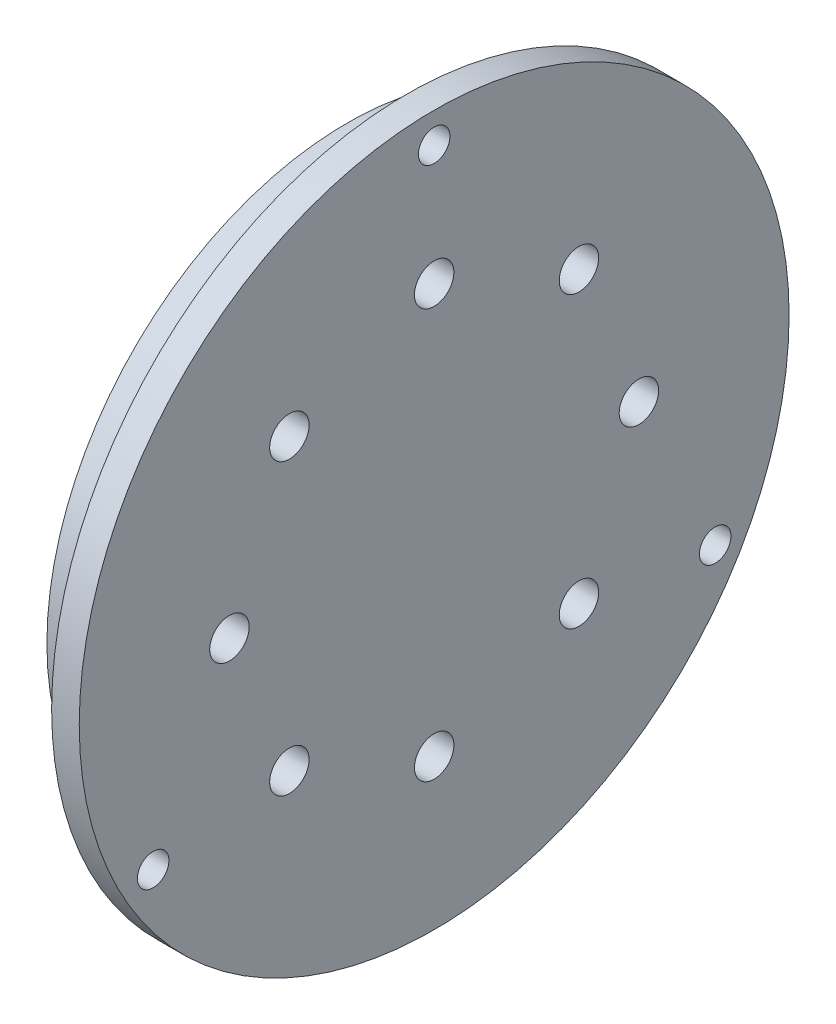
ISO-10303-21;
HEADER;
FILE_DESCRIPTION(('STEP AP214'),'2;1');
FILE_NAME('part.step','',(''),(''),'','','');
FILE_SCHEMA(('AUTOMOTIVE_DESIGN { 1 0 10303 214 1 1 1 1 }'));
ENDSEC;
DATA;
#1=APPLICATION_CONTEXT('core data for automotive mechanical design processes');
#2=APPLICATION_PROTOCOL_DEFINITION('international standard','automotive_design',2000,#1);
#3=PRODUCT_CONTEXT('',#1,'mechanical');
#4=PRODUCT('Part','Part','',(#3));
#5=PRODUCT_RELATED_PRODUCT_CATEGORY('part','',(#4));
#6=PRODUCT_DEFINITION_FORMATION('','',#4);
#7=PRODUCT_DEFINITION_CONTEXT('part definition',#1,'design');
#8=PRODUCT_DEFINITION('design','',#6,#7);
#9=PRODUCT_DEFINITION_SHAPE('','',#8);
#10=(LENGTH_UNIT() NAMED_UNIT(*) SI_UNIT(.MILLI.,.METRE.));
#11=(NAMED_UNIT(*) PLANE_ANGLE_UNIT() SI_UNIT($,.RADIAN.));
#12=(NAMED_UNIT(*) SI_UNIT($,.STERADIAN.) SOLID_ANGLE_UNIT());
#13=UNCERTAINTY_MEASURE_WITH_UNIT(LENGTH_MEASURE(1.E-05),#10,'distance_accuracy_value','');
#14=(GEOMETRIC_REPRESENTATION_CONTEXT(3) GLOBAL_UNCERTAINTY_ASSIGNED_CONTEXT((#13)) GLOBAL_UNIT_ASSIGNED_CONTEXT((#10,
#11,#12)) REPRESENTATION_CONTEXT('',''));
#15=CARTESIAN_POINT('',(0.,0.,0.));
#16=DIRECTION('',(0.,0.,1.));
#17=DIRECTION('',(1.,0.,0.));
#18=AXIS2_PLACEMENT_3D('',#15,#16,#17);
#19=CARTESIAN_POINT('',(0.,0.,0.));
#20=DIRECTION('',(-1.,0.,0.));
#21=DIRECTION('',(0.,0.,1.));
#22=AXIS2_PLACEMENT_3D('',#19,#20,#21);
#23=PLANE('',#22);
#24=CARTESIAN_POINT('',(0.,-1.81266086441026E-13,51.9166705616954));
#25=DIRECTION('',(-1.,0.,0.));
#26=DIRECTION('',(0.,-1.,0.));
#27=AXIS2_PLACEMENT_3D('',#24,#25,#26);
#28=CIRCLE('',#27,5.);
#29=CARTESIAN_POINT('',(0.,-5.00000000000018,51.9166705616953));
#30=VERTEX_POINT('',#29);
#31=EDGE_CURVE('E112',#30,#30,#28,.T.);
#32=ORIENTED_EDGE('',*,*,#31,.F.);
#33=EDGE_LOOP('',(#32));
#34=FACE_BOUND('',#33,.T.);
#35=CARTESIAN_POINT('',(0.,-36.710629810803,36.7106298108026));
#36=DIRECTION('',(-1.,0.,0.));
#37=DIRECTION('',(0.,-0.707106781186544,-0.707106781186551));
#38=AXIS2_PLACEMENT_3D('',#35,#36,#37);
#39=CIRCLE('',#38,5.);
#40=CARTESIAN_POINT('',(0.,-40.2461637167357,33.1750959048698));
#41=VERTEX_POINT('',#40);
#42=EDGE_CURVE('E116',#41,#41,#39,.T.);
#43=ORIENTED_EDGE('',*,*,#42,.F.);
#44=EDGE_LOOP('',(#43));
#45=FACE_BOUND('',#44,.T.);
#46=CARTESIAN_POINT('',(0.,-51.9166705616954,0.));
#47=DIRECTION('',(-1.,0.,0.));
#48=DIRECTION('',(0.,0.,-1.));
#49=AXIS2_PLACEMENT_3D('',#46,#47,#48);
#50=CIRCLE('',#49,5.);
#51=CARTESIAN_POINT('',(0.,-51.9166705616954,-5.));
#52=VERTEX_POINT('',#51);
#53=EDGE_CURVE('E120',#52,#52,#50,.T.);
#54=ORIENTED_EDGE('',*,*,#53,.F.);
#55=EDGE_LOOP('',(#54));
#56=FACE_BOUND('',#55,.T.);
#57=CARTESIAN_POINT('',(0.,-36.7106298108025,-36.7106298108031));
#58=DIRECTION('',(-1.,0.,0.));
#59=DIRECTION('',(0.,0.707106781186554,-0.707106781186541));
#60=AXIS2_PLACEMENT_3D('',#57,#58,#59);
#61=CIRCLE('',#60,5.);
#62=CARTESIAN_POINT('',(0.,-33.1750959048697,-40.2461637167358));
#63=VERTEX_POINT('',#62);
#64=EDGE_CURVE('E124',#63,#63,#61,.T.);
#65=ORIENTED_EDGE('',*,*,#64,.F.);
#66=EDGE_LOOP('',(#65));
#67=FACE_BOUND('',#66,.T.);
#68=CARTESIAN_POINT('',(0.,5.43798259323078E-13,-51.9166705616954));
#69=DIRECTION('',(-1.,0.,0.));
#70=DIRECTION('',(0.,1.,0.));
#71=AXIS2_PLACEMENT_3D('',#68,#69,#70);
#72=CIRCLE('',#71,5.);
#73=CARTESIAN_POINT('',(0.,5.00000000000054,-51.9166705616953));
#74=VERTEX_POINT('',#73);
#75=EDGE_CURVE('E128',#74,#74,#72,.T.);
#76=ORIENTED_EDGE('',*,*,#75,.F.);
#77=EDGE_LOOP('',(#76));
#78=FACE_BOUND('',#77,.T.);
#79=CARTESIAN_POINT('',(0.,36.7106298108032,-36.7106298108023));
#80=DIRECTION('',(-1.,0.,0.));
#81=DIRECTION('',(0.,0.707106781186539,0.707106781186556));
#82=AXIS2_PLACEMENT_3D('',#79,#80,#81);
#83=CIRCLE('',#82,5.);
#84=CARTESIAN_POINT('',(0.,40.2461637167359,-33.1750959048696));
#85=VERTEX_POINT('',#84);
#86=EDGE_CURVE('E132',#85,#85,#83,.T.);
#87=ORIENTED_EDGE('',*,*,#86,.F.);
#88=EDGE_LOOP('',(#87));
#89=FACE_BOUND('',#88,.T.);
#90=CARTESIAN_POINT('',(0.,36.7106298108027,36.7106298108029));
#91=DIRECTION('',(-1.,0.,0.));
#92=DIRECTION('',(0.,-0.707106781186549,0.707106781186546));
#93=AXIS2_PLACEMENT_3D('',#90,#91,#92);
#94=CIRCLE('',#93,5.);
#95=CARTESIAN_POINT('',(0.,33.17509590487,40.2461637167356));
#96=VERTEX_POINT('',#95);
#97=EDGE_CURVE('E136',#96,#96,#94,.T.);
#98=ORIENTED_EDGE('',*,*,#97,.F.);
#99=EDGE_LOOP('',(#98));
#100=FACE_BOUND('',#99,.T.);
#101=CARTESIAN_POINT('',(0.,51.9166705616954,0.));
#102=DIRECTION('',(-1.,0.,0.));
#103=DIRECTION('',(0.,0.,1.));
#104=AXIS2_PLACEMENT_3D('',#101,#102,#103);
#105=CIRCLE('',#104,5.);
#106=CARTESIAN_POINT('',(0.,51.9166705616954,5.));
#107=VERTEX_POINT('',#106);
#108=EDGE_CURVE('E68',#107,#107,#105,.T.);
#109=ORIENTED_EDGE('',*,*,#108,.F.);
#110=EDGE_LOOP('',(#109));
#111=FACE_BOUND('',#110,.T.);
#112=CARTESIAN_POINT('',(0.,0.,0.));
#113=DIRECTION('',(1.,0.,0.));
#114=DIRECTION('',(0.,0.,-1.));
#115=AXIS2_PLACEMENT_3D('',#112,#113,#114);
#116=CIRCLE('',#115,76.2);
#117=CARTESIAN_POINT('',(0.,0.,-76.2));
#118=VERTEX_POINT('',#117);
#119=EDGE_CURVE('E10',#118,#118,#116,.T.);
#120=ORIENTED_EDGE('',*,*,#119,.F.);
#121=EDGE_LOOP('',(#120));
#122=FACE_BOUND('',#121,.T.);
#123=ADVANCED_FACE('F33',(#34,#45,#56,#67,#78,#89,#100,#111,#122),#23,.T.);
#124=CARTESIAN_POINT('',(22.,0.,0.));
#125=DIRECTION('',(1.,0.,0.));
#126=DIRECTION('',(0.,0.,-1.));
#127=AXIS2_PLACEMENT_3D('',#124,#125,#126);
#128=CYLINDRICAL_SURFACE('',#127,76.2);
#129=ORIENTED_EDGE('',*,*,#119,.T.);
#130=EDGE_LOOP('',(#129));
#131=FACE_BOUND('',#130,.T.);
#132=CARTESIAN_POINT('',(5.47541952646213,0.,0.));
#133=DIRECTION('',(1.,0.,0.));
#134=DIRECTION('',(0.,0.,-1.));
#135=AXIS2_PLACEMENT_3D('',#132,#133,#134);
#136=CIRCLE('',#135,76.2);
#137=CARTESIAN_POINT('',(5.47541952646213,0.,-76.2));
#138=VERTEX_POINT('',#137);
#139=EDGE_CURVE('E40',#138,#138,#136,.T.);
#140=ORIENTED_EDGE('',*,*,#139,.F.);
#141=EDGE_LOOP('',(#140));
#142=FACE_BOUND('',#141,.T.);
#143=ADVANCED_FACE('F94',(#131,#142),#128,.T.);
#144=CARTESIAN_POINT('',(5.47541952646213,72.8465829878076,0.));
#145=DIRECTION('',(1.,0.,0.));
#146=DIRECTION('',(0.,0.,-1.));
#147=AXIS2_PLACEMENT_3D('',#144,#145,#146);
#148=PLANE('',#147);
#149=ORIENTED_EDGE('',*,*,#139,.T.);
#150=EDGE_LOOP('',(#149));
#151=FACE_BOUND('',#150,.T.);
#152=CARTESIAN_POINT('',(5.47541952646213,0.,0.));
#153=DIRECTION('',(1.,0.,0.));
#154=DIRECTION('',(0.,0.,-1.));
#155=AXIS2_PLACEMENT_3D('',#152,#153,#154);
#156=CIRCLE('',#155,72.8465829878076);
#157=CARTESIAN_POINT('',(5.47541952646213,0.,-72.8465829878076));
#158=VERTEX_POINT('',#157);
#159=EDGE_CURVE('E45',#158,#158,#156,.T.);
#160=ORIENTED_EDGE('',*,*,#159,.F.);
#161=EDGE_LOOP('',(#160));
#162=FACE_BOUND('',#161,.T.);
#163=ADVANCED_FACE('F92',(#151,#162),#148,.T.);
#164=CARTESIAN_POINT('',(22.,0.,0.));
#165=DIRECTION('',(1.,0.,0.));
#166=DIRECTION('',(0.,0.,-1.));
#167=AXIS2_PLACEMENT_3D('',#164,#165,#166);
#168=CYLINDRICAL_SURFACE('',#167,72.8465829878076);
#169=ORIENTED_EDGE('',*,*,#159,.T.);
#170=EDGE_LOOP('',(#169));
#171=FACE_BOUND('',#170,.T.);
#172=CARTESIAN_POINT('',(9.8226098235159,0.,0.));
#173=DIRECTION('',(1.,0.,0.));
#174=DIRECTION('',(0.,0.,-1.));
#175=AXIS2_PLACEMENT_3D('',#172,#173,#174);
#176=CIRCLE('',#175,72.8465829878076);
#177=CARTESIAN_POINT('',(9.8226098235159,0.,-72.8465829878076));
#178=VERTEX_POINT('',#177);
#179=EDGE_CURVE('E84',#178,#178,#176,.T.);
#180=ORIENTED_EDGE('',*,*,#179,.F.);
#181=EDGE_LOOP('',(#180));
#182=FACE_BOUND('',#181,.T.);
#183=ADVANCED_FACE('F89',(#171,#182),#168,.T.);
#184=CARTESIAN_POINT('',(9.8226098235159,76.2,0.));
#185=DIRECTION('',(-1.,0.,0.));
#186=DIRECTION('',(0.,0.,1.));
#187=AXIS2_PLACEMENT_3D('',#184,#185,#186);
#188=PLANE('',#187);
#189=ORIENTED_EDGE('',*,*,#179,.T.);
#190=EDGE_LOOP('',(#189));
#191=FACE_BOUND('',#190,.T.);
#192=CARTESIAN_POINT('',(9.8226098235159,0.,0.));
#193=DIRECTION('',(1.,0.,0.));
#194=DIRECTION('',(0.,0.,-1.));
#195=AXIS2_PLACEMENT_3D('',#192,#193,#194);
#196=CIRCLE('',#195,76.2);
#197=CARTESIAN_POINT('',(9.8226098235159,0.,-76.2));
#198=VERTEX_POINT('',#197);
#199=EDGE_CURVE('E81',#198,#198,#196,.T.);
#200=ORIENTED_EDGE('',*,*,#199,.F.);
#201=EDGE_LOOP('',(#200));
#202=FACE_BOUND('',#201,.T.);
#203=ADVANCED_FACE('F101',(#191,#202),#188,.T.);
#204=CARTESIAN_POINT('',(22.,0.,0.));
#205=DIRECTION('',(1.,0.,0.));
#206=DIRECTION('',(0.,0.,-1.));
#207=AXIS2_PLACEMENT_3D('',#204,#205,#206);
#208=CYLINDRICAL_SURFACE('',#207,76.2);
#209=ORIENTED_EDGE('',*,*,#199,.T.);
#210=EDGE_LOOP('',(#209));
#211=FACE_BOUND('',#210,.T.);
#212=CARTESIAN_POINT('',(15.,0.,0.));
#213=DIRECTION('',(1.,0.,0.));
#214=DIRECTION('',(0.,0.,-1.));
#215=AXIS2_PLACEMENT_3D('',#212,#213,#214);
#216=CIRCLE('',#215,76.2);
#217=CARTESIAN_POINT('',(15.,0.,-76.2));
#218=VERTEX_POINT('',#217);
#219=EDGE_CURVE('E78',#218,#218,#216,.T.);
#220=ORIENTED_EDGE('',*,*,#219,.F.);
#221=EDGE_LOOP('',(#220));
#222=FACE_BOUND('',#221,.T.);
#223=ADVANCED_FACE('F232',(#211,#222),#208,.T.);
#224=CARTESIAN_POINT('',(15.,76.2,0.));
#225=DIRECTION('',(-1.,0.,0.));
#226=DIRECTION('',(0.,0.,1.));
#227=AXIS2_PLACEMENT_3D('',#224,#225,#226);
#228=PLANE('',#227);
#229=CARTESIAN_POINT('',(15.,-41.1386633438073,71.2542550669448));
#230=DIRECTION('',(-1.,0.,0.));
#231=DIRECTION('',(0.,-0.866025403784436,-0.500000000000004));
#232=AXIS2_PLACEMENT_3D('',#229,#230,#231);
#233=CIRCLE('',#232,4.);
#234=CARTESIAN_POINT('',(15.,-44.602764958945,69.2542550669448));
#235=VERTEX_POINT('',#234);
#236=EDGE_CURVE('E55',#235,#235,#233,.T.);
#237=ORIENTED_EDGE('',*,*,#236,.F.);
#238=EDGE_LOOP('',(#237));
#239=FACE_BOUND('',#238,.T.);
#240=CARTESIAN_POINT('',(15.,-41.1386633438063,-71.2542550669453));
#241=DIRECTION('',(-1.,0.,0.));
#242=DIRECTION('',(0.,0.866025403784443,-0.499999999999992));
#243=AXIS2_PLACEMENT_3D('',#240,#241,#242);
#244=CIRCLE('',#243,4.);
#245=CARTESIAN_POINT('',(15.,-37.6745617286685,-73.2542550669453));
#246=VERTEX_POINT('',#245);
#247=EDGE_CURVE('E60',#246,#246,#244,.T.);
#248=ORIENTED_EDGE('',*,*,#247,.F.);
#249=EDGE_LOOP('',(#248));
#250=FACE_BOUND('',#249,.T.);
#251=CARTESIAN_POINT('',(15.,82.2773266876138,0.));
#252=DIRECTION('',(-1.,0.,0.));
#253=DIRECTION('',(0.,0.,1.));
#254=AXIS2_PLACEMENT_3D('',#251,#252,#253);
#255=CIRCLE('',#254,4.);
#256=CARTESIAN_POINT('',(15.,82.2773266876138,4.));
#257=VERTEX_POINT('',#256);
#258=EDGE_CURVE('E52',#257,#257,#255,.T.);
#259=ORIENTED_EDGE('',*,*,#258,.F.);
#260=EDGE_LOOP('',(#259));
#261=FACE_BOUND('',#260,.T.);
#262=ORIENTED_EDGE('',*,*,#219,.T.);
#263=EDGE_LOOP('',(#262));
#264=FACE_BOUND('',#263,.T.);
#265=CARTESIAN_POINT('',(15.,0.,0.));
#266=DIRECTION('',(1.,0.,0.));
#267=DIRECTION('',(0.,0.,-1.));
#268=AXIS2_PLACEMENT_3D('',#265,#266,#267);
#269=CIRCLE('',#268,90.);
#270=CARTESIAN_POINT('',(15.,0.,-90.));
#271=VERTEX_POINT('',#270);
#272=EDGE_CURVE('E75',#271,#271,#269,.T.);
#273=ORIENTED_EDGE('',*,*,#272,.F.);
#274=EDGE_LOOP('',(#273));
#275=FACE_BOUND('',#274,.T.);
#276=ADVANCED_FACE('F228',(#239,#250,#261,#264,#275),#228,.T.);
#277=CARTESIAN_POINT('',(22.,0.,0.));
#278=DIRECTION('',(1.,0.,0.));
#279=DIRECTION('',(0.,0.,-1.));
#280=AXIS2_PLACEMENT_3D('',#277,#278,#279);
#281=CYLINDRICAL_SURFACE('',#280,90.);
#282=ORIENTED_EDGE('',*,*,#272,.T.);
#283=EDGE_LOOP('',(#282));
#284=FACE_BOUND('',#283,.T.);
#285=CARTESIAN_POINT('',(22.,0.,0.));
#286=DIRECTION('',(1.,0.,0.));
#287=DIRECTION('',(0.,0.,-1.));
#288=AXIS2_PLACEMENT_3D('',#285,#286,#287);
#289=CIRCLE('',#288,90.);
#290=CARTESIAN_POINT('',(22.,0.,-90.));
#291=VERTEX_POINT('',#290);
#292=EDGE_CURVE('E51',#291,#291,#289,.T.);
#293=ORIENTED_EDGE('',*,*,#292,.F.);
#294=EDGE_LOOP('',(#293));
#295=FACE_BOUND('',#294,.T.);
#296=ADVANCED_FACE('F224',(#284,#295),#281,.T.);
#297=CARTESIAN_POINT('',(22.,90.,0.));
#298=DIRECTION('',(1.,0.,0.));
#299=DIRECTION('',(0.,0.,-1.));
#300=AXIS2_PLACEMENT_3D('',#297,#298,#299);
#301=PLANE('',#300);
#302=CARTESIAN_POINT('',(22.,-1.81266086441026E-13,51.9166705616954));
#303=DIRECTION('',(-1.,0.,0.));
#304=DIRECTION('',(0.,-1.,0.));
#305=AXIS2_PLACEMENT_3D('',#302,#303,#304);
#306=CIRCLE('',#305,5.);
#307=CARTESIAN_POINT('',(22.,-5.00000000000018,51.9166705616953));
#308=VERTEX_POINT('',#307);
#309=EDGE_CURVE('E147',#308,#308,#306,.T.);
#310=ORIENTED_EDGE('',*,*,#309,.T.);
#311=EDGE_LOOP('',(#310));
#312=FACE_BOUND('',#311,.T.);
#313=CARTESIAN_POINT('',(22.,-36.710629810803,36.7106298108026));
#314=DIRECTION('',(-1.,0.,0.));
#315=DIRECTION('',(0.,-0.707106781186544,-0.707106781186551));
#316=AXIS2_PLACEMENT_3D('',#313,#314,#315);
#317=CIRCLE('',#316,5.);
#318=CARTESIAN_POINT('',(22.,-40.2461637167357,33.1750959048698));
#319=VERTEX_POINT('',#318);
#320=EDGE_CURVE('E160',#319,#319,#317,.T.);
#321=ORIENTED_EDGE('',*,*,#320,.T.);
#322=EDGE_LOOP('',(#321));
#323=FACE_BOUND('',#322,.T.);
#324=CARTESIAN_POINT('',(22.,-51.9166705616954,0.));
#325=DIRECTION('',(-1.,0.,0.));
#326=DIRECTION('',(0.,0.,-1.));
#327=AXIS2_PLACEMENT_3D('',#324,#325,#326);
#328=CIRCLE('',#327,5.);
#329=CARTESIAN_POINT('',(22.,-51.9166705616954,-5.));
#330=VERTEX_POINT('',#329);
#331=EDGE_CURVE('E156',#330,#330,#328,.T.);
#332=ORIENTED_EDGE('',*,*,#331,.T.);
#333=EDGE_LOOP('',(#332));
#334=FACE_BOUND('',#333,.T.);
#335=CARTESIAN_POINT('',(22.,-36.7106298108025,-36.7106298108031));
#336=DIRECTION('',(-1.,0.,0.));
#337=DIRECTION('',(0.,0.707106781186554,-0.707106781186541));
#338=AXIS2_PLACEMENT_3D('',#335,#336,#337);
#339=CIRCLE('',#338,5.);
#340=CARTESIAN_POINT('',(22.,-33.1750959048697,-40.2461637167358));
#341=VERTEX_POINT('',#340);
#342=EDGE_CURVE('E151',#341,#341,#339,.T.);
#343=ORIENTED_EDGE('',*,*,#342,.T.);
#344=EDGE_LOOP('',(#343));
#345=FACE_BOUND('',#344,.T.);
#346=CARTESIAN_POINT('',(22.,5.43798259323078E-13,-51.9166705616954));
#347=DIRECTION('',(-1.,0.,0.));
#348=DIRECTION('',(0.,1.,0.));
#349=AXIS2_PLACEMENT_3D('',#346,#347,#348);
#350=CIRCLE('',#349,5.);
#351=CARTESIAN_POINT('',(22.,5.00000000000054,-51.9166705616953));
#352=VERTEX_POINT('',#351);
#353=EDGE_CURVE('E152',#352,#352,#350,.T.);
#354=ORIENTED_EDGE('',*,*,#353,.T.);
#355=EDGE_LOOP('',(#354));
#356=FACE_BOUND('',#355,.T.);
#357=CARTESIAN_POINT('',(22.,36.7106298108032,-36.7106298108023));
#358=DIRECTION('',(-1.,0.,0.));
#359=DIRECTION('',(0.,0.707106781186539,0.707106781186556));
#360=AXIS2_PLACEMENT_3D('',#357,#358,#359);
#361=CIRCLE('',#360,5.);
#362=CARTESIAN_POINT('',(22.,40.2461637167359,-33.1750959048696));
#363=VERTEX_POINT('',#362);
#364=EDGE_CURVE('E167',#363,#363,#361,.T.);
#365=ORIENTED_EDGE('',*,*,#364,.T.);
#366=EDGE_LOOP('',(#365));
#367=FACE_BOUND('',#366,.T.);
#368=CARTESIAN_POINT('',(22.,36.7106298108027,36.7106298108029));
#369=DIRECTION('',(-1.,0.,0.));
#370=DIRECTION('',(0.,-0.707106781186549,0.707106781186546));
#371=AXIS2_PLACEMENT_3D('',#368,#369,#370);
#372=CIRCLE('',#371,5.);
#373=CARTESIAN_POINT('',(22.,33.17509590487,40.2461637167356));
#374=VERTEX_POINT('',#373);
#375=EDGE_CURVE('E141',#374,#374,#372,.T.);
#376=ORIENTED_EDGE('',*,*,#375,.T.);
#377=EDGE_LOOP('',(#376));
#378=FACE_BOUND('',#377,.T.);
#379=CARTESIAN_POINT('',(22.,51.9166705616954,0.));
#380=DIRECTION('',(-1.,0.,0.));
#381=DIRECTION('',(0.,0.,1.));
#382=AXIS2_PLACEMENT_3D('',#379,#380,#381);
#383=CIRCLE('',#382,5.);
#384=CARTESIAN_POINT('',(22.,51.9166705616954,5.));
#385=VERTEX_POINT('',#384);
#386=EDGE_CURVE('E65',#385,#385,#383,.T.);
#387=ORIENTED_EDGE('',*,*,#386,.T.);
#388=EDGE_LOOP('',(#387));
#389=FACE_BOUND('',#388,.T.);
#390=CARTESIAN_POINT('',(22.,-41.1386633438073,71.2542550669448));
#391=DIRECTION('',(1.,0.,0.));
#392=DIRECTION('',(0.,0.,-1.));
#393=AXIS2_PLACEMENT_3D('',#390,#391,#392);
#394=CIRCLE('',#393,4.);
#395=CARTESIAN_POINT('',(22.,-41.1386633438073,67.2542550669448));
#396=VERTEX_POINT('',#395);
#397=EDGE_CURVE('E36',#396,#396,#394,.T.);
#398=ORIENTED_EDGE('',*,*,#397,.F.);
#399=EDGE_LOOP('',(#398));
#400=FACE_BOUND('',#399,.T.);
#401=CARTESIAN_POINT('',(22.,-41.1386633438063,-71.2542550669453));
#402=DIRECTION('',(1.,0.,0.));
#403=DIRECTION('',(0.,0.,-1.));
#404=AXIS2_PLACEMENT_3D('',#401,#402,#403);
#405=CIRCLE('',#404,4.);
#406=CARTESIAN_POINT('',(22.,-41.1386633438063,-75.2542550669453));
#407=VERTEX_POINT('',#406);
#408=EDGE_CURVE('E53',#407,#407,#405,.T.);
#409=ORIENTED_EDGE('',*,*,#408,.F.);
#410=EDGE_LOOP('',(#409));
#411=FACE_BOUND('',#410,.T.);
#412=CARTESIAN_POINT('',(22.,82.2773266876138,0.));
#413=DIRECTION('',(1.,0.,0.));
#414=DIRECTION('',(0.,0.,-1.));
#415=AXIS2_PLACEMENT_3D('',#412,#413,#414);
#416=CIRCLE('',#415,4.);
#417=CARTESIAN_POINT('',(22.,82.2773266876138,-4.));
#418=VERTEX_POINT('',#417);
#419=EDGE_CURVE('E49',#418,#418,#416,.T.);
#420=ORIENTED_EDGE('',*,*,#419,.F.);
#421=EDGE_LOOP('',(#420));
#422=FACE_BOUND('',#421,.T.);
#423=ORIENTED_EDGE('',*,*,#292,.T.);
#424=EDGE_LOOP('',(#423));
#425=FACE_BOUND('',#424,.T.);
#426=ADVANCED_FACE('F174',(#312,#323,#334,#345,#356,#367,#378,#389,#400,#411,#422,#425),#301,.T.);
#427=CARTESIAN_POINT('',(25.,82.2773266876138,0.));
#428=DIRECTION('',(-1.,0.,0.));
#429=DIRECTION('',(0.,0.,1.));
#430=AXIS2_PLACEMENT_3D('',#427,#428,#429);
#431=CYLINDRICAL_SURFACE('',#430,4.);
#432=ORIENTED_EDGE('',*,*,#419,.T.);
#433=EDGE_LOOP('',(#432));
#434=FACE_BOUND('',#433,.T.);
#435=ORIENTED_EDGE('',*,*,#258,.T.);
#436=EDGE_LOOP('',(#435));
#437=FACE_BOUND('',#436,.T.);
#438=ADVANCED_FACE('F219',(#434,#437),#431,.F.);
#439=CARTESIAN_POINT('',(25.,-41.1386633438063,-71.2542550669453));
#440=DIRECTION('',(-1.,0.,0.));
#441=DIRECTION('',(0.,0.,1.));
#442=AXIS2_PLACEMENT_3D('',#439,#440,#441);
#443=CYLINDRICAL_SURFACE('',#442,4.);
#444=ORIENTED_EDGE('',*,*,#408,.T.);
#445=EDGE_LOOP('',(#444));
#446=FACE_BOUND('',#445,.T.);
#447=ORIENTED_EDGE('',*,*,#247,.T.);
#448=EDGE_LOOP('',(#447));
#449=FACE_BOUND('',#448,.T.);
#450=ADVANCED_FACE('F215',(#446,#449),#443,.F.);
#451=CARTESIAN_POINT('',(25.,-41.1386633438073,71.2542550669448));
#452=DIRECTION('',(-1.,0.,0.));
#453=DIRECTION('',(0.,0.,1.));
#454=AXIS2_PLACEMENT_3D('',#451,#452,#453);
#455=CYLINDRICAL_SURFACE('',#454,4.);
#456=ORIENTED_EDGE('',*,*,#397,.T.);
#457=EDGE_LOOP('',(#456));
#458=FACE_BOUND('',#457,.T.);
#459=ORIENTED_EDGE('',*,*,#236,.T.);
#460=EDGE_LOOP('',(#459));
#461=FACE_BOUND('',#460,.T.);
#462=ADVANCED_FACE('F211',(#458,#461),#455,.F.);
#463=CARTESIAN_POINT('',(22.,51.9166705616954,0.));
#464=DIRECTION('',(-1.,0.,0.));
#465=DIRECTION('',(0.,0.,1.));
#466=AXIS2_PLACEMENT_3D('',#463,#464,#465);
#467=CYLINDRICAL_SURFACE('',#466,5.);
#468=ORIENTED_EDGE('',*,*,#386,.F.);
#469=EDGE_LOOP('',(#468));
#470=FACE_BOUND('',#469,.T.);
#471=ORIENTED_EDGE('',*,*,#108,.T.);
#472=EDGE_LOOP('',(#471));
#473=FACE_BOUND('',#472,.T.);
#474=ADVANCED_FACE('F207',(#470,#473),#467,.F.);
#475=CARTESIAN_POINT('',(22.,36.7106298108027,36.7106298108029));
#476=DIRECTION('',(-1.,0.,0.));
#477=DIRECTION('',(0.,0.,1.));
#478=AXIS2_PLACEMENT_3D('',#475,#476,#477);
#479=CYLINDRICAL_SURFACE('',#478,5.);
#480=ORIENTED_EDGE('',*,*,#375,.F.);
#481=EDGE_LOOP('',(#480));
#482=FACE_BOUND('',#481,.T.);
#483=ORIENTED_EDGE('',*,*,#97,.T.);
#484=EDGE_LOOP('',(#483));
#485=FACE_BOUND('',#484,.T.);
#486=ADVANCED_FACE('F190',(#482,#485),#479,.F.);
#487=CARTESIAN_POINT('',(22.,36.7106298108032,-36.7106298108023));
#488=DIRECTION('',(-1.,0.,0.));
#489=DIRECTION('',(0.,0.,1.));
#490=AXIS2_PLACEMENT_3D('',#487,#488,#489);
#491=CYLINDRICAL_SURFACE('',#490,5.);
#492=ORIENTED_EDGE('',*,*,#364,.F.);
#493=EDGE_LOOP('',(#492));
#494=FACE_BOUND('',#493,.T.);
#495=ORIENTED_EDGE('',*,*,#86,.T.);
#496=EDGE_LOOP('',(#495));
#497=FACE_BOUND('',#496,.T.);
#498=ADVANCED_FACE('F181',(#494,#497),#491,.F.);
#499=CARTESIAN_POINT('',(22.,5.43798259323078E-13,-51.9166705616954));
#500=DIRECTION('',(-1.,0.,0.));
#501=DIRECTION('',(0.,0.,1.));
#502=AXIS2_PLACEMENT_3D('',#499,#500,#501);
#503=CYLINDRICAL_SURFACE('',#502,5.);
#504=ORIENTED_EDGE('',*,*,#353,.F.);
#505=EDGE_LOOP('',(#504));
#506=FACE_BOUND('',#505,.T.);
#507=ORIENTED_EDGE('',*,*,#75,.T.);
#508=EDGE_LOOP('',(#507));
#509=FACE_BOUND('',#508,.T.);
#510=ADVANCED_FACE('F177',(#506,#509),#503,.F.);
#511=CARTESIAN_POINT('',(22.,-36.7106298108025,-36.7106298108031));
#512=DIRECTION('',(-1.,0.,0.));
#513=DIRECTION('',(0.,0.,1.));
#514=AXIS2_PLACEMENT_3D('',#511,#512,#513);
#515=CYLINDRICAL_SURFACE('',#514,5.);
#516=ORIENTED_EDGE('',*,*,#342,.F.);
#517=EDGE_LOOP('',(#516));
#518=FACE_BOUND('',#517,.T.);
#519=ORIENTED_EDGE('',*,*,#64,.T.);
#520=EDGE_LOOP('',(#519));
#521=FACE_BOUND('',#520,.T.);
#522=ADVANCED_FACE('F180',(#518,#521),#515,.F.);
#523=CARTESIAN_POINT('',(22.,-51.9166705616954,0.));
#524=DIRECTION('',(-1.,0.,0.));
#525=DIRECTION('',(0.,0.,1.));
#526=AXIS2_PLACEMENT_3D('',#523,#524,#525);
#527=CYLINDRICAL_SURFACE('',#526,5.);
#528=ORIENTED_EDGE('',*,*,#331,.F.);
#529=EDGE_LOOP('',(#528));
#530=FACE_BOUND('',#529,.T.);
#531=ORIENTED_EDGE('',*,*,#53,.T.);
#532=EDGE_LOOP('',(#531));
#533=FACE_BOUND('',#532,.T.);
#534=ADVANCED_FACE('F187',(#530,#533),#527,.F.);
#535=CARTESIAN_POINT('',(22.,-36.710629810803,36.7106298108026));
#536=DIRECTION('',(-1.,0.,0.));
#537=DIRECTION('',(0.,0.,1.));
#538=AXIS2_PLACEMENT_3D('',#535,#536,#537);
#539=CYLINDRICAL_SURFACE('',#538,5.);
#540=ORIENTED_EDGE('',*,*,#320,.F.);
#541=EDGE_LOOP('',(#540));
#542=FACE_BOUND('',#541,.T.);
#543=ORIENTED_EDGE('',*,*,#42,.T.);
#544=EDGE_LOOP('',(#543));
#545=FACE_BOUND('',#544,.T.);
#546=ADVANCED_FACE('F197',(#542,#545),#539,.F.);
#547=CARTESIAN_POINT('',(22.,-1.81266086441026E-13,51.9166705616954));
#548=DIRECTION('',(-1.,0.,0.));
#549=DIRECTION('',(0.,0.,1.));
#550=AXIS2_PLACEMENT_3D('',#547,#548,#549);
#551=CYLINDRICAL_SURFACE('',#550,5.);
#552=ORIENTED_EDGE('',*,*,#309,.F.);
#553=EDGE_LOOP('',(#552));
#554=FACE_BOUND('',#553,.T.);
#555=ORIENTED_EDGE('',*,*,#31,.T.);
#556=EDGE_LOOP('',(#555));
#557=FACE_BOUND('',#556,.T.);
#558=ADVANCED_FACE('F194',(#554,#557),#551,.F.);
#559=CLOSED_SHELL('',(#123,#143,#163,#183,#203,#223,#276,#296,#426,#438,#450,#462,#474,#486,
#498,#510,#522,#534,#546,#558));
#560=MANIFOLD_SOLID_BREP('B2',#559);
#561=ADVANCED_BREP_SHAPE_REPRESENTATION('',(#18,#560),#14);
#562=SHAPE_DEFINITION_REPRESENTATION(#9,#561);
ENDSEC;
END-ISO-10303-21;
